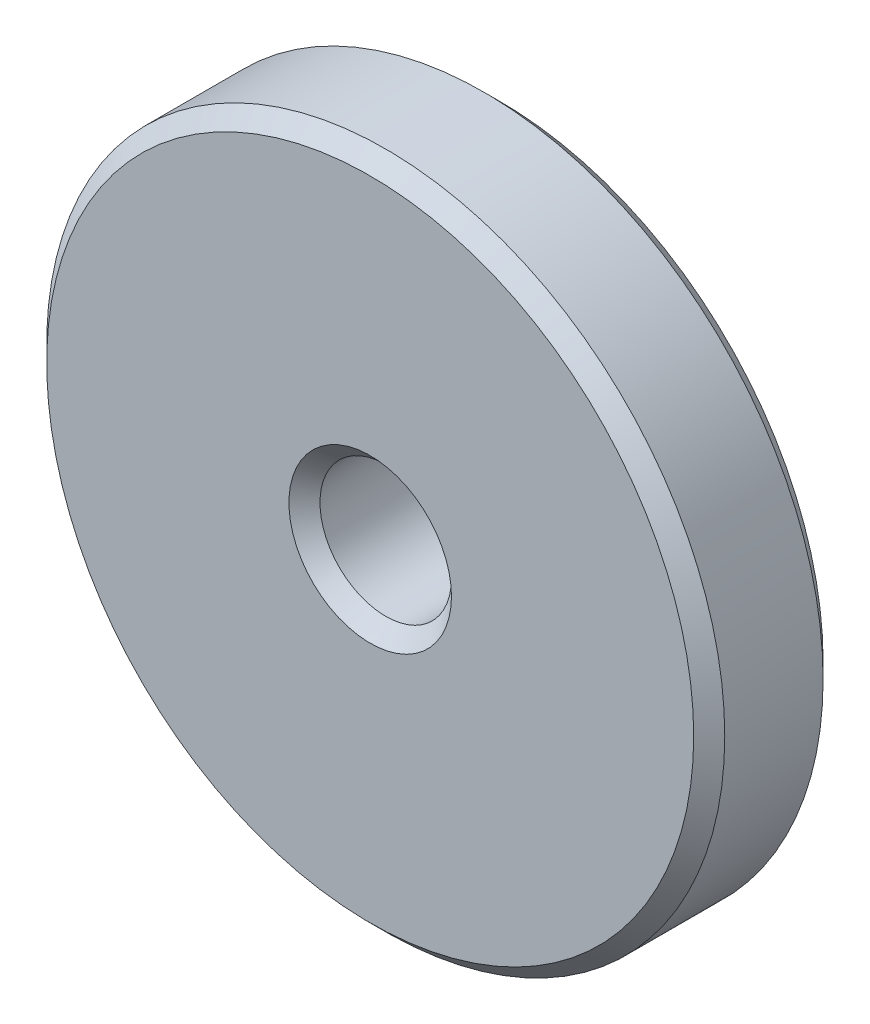
ISO-10303-21;
HEADER;
FILE_DESCRIPTION(('STEP AP214'),'2;1');
FILE_NAME('part.step','',(''),(''),'','','');
FILE_SCHEMA(('AUTOMOTIVE_DESIGN { 1 0 10303 214 1 1 1 1 }'));
ENDSEC;
DATA;
#1=APPLICATION_CONTEXT('core data for automotive mechanical design processes');
#2=APPLICATION_PROTOCOL_DEFINITION('international standard','automotive_design',2000,#1);
#3=PRODUCT_CONTEXT('',#1,'mechanical');
#4=PRODUCT('Part','Part','',(#3));
#5=PRODUCT_RELATED_PRODUCT_CATEGORY('part','',(#4));
#6=PRODUCT_DEFINITION_FORMATION('','',#4);
#7=PRODUCT_DEFINITION_CONTEXT('part definition',#1,'design');
#8=PRODUCT_DEFINITION('design','',#6,#7);
#9=PRODUCT_DEFINITION_SHAPE('','',#8);
#10=(LENGTH_UNIT() NAMED_UNIT(*) SI_UNIT(.MILLI.,.METRE.));
#11=(NAMED_UNIT(*) PLANE_ANGLE_UNIT() SI_UNIT($,.RADIAN.));
#12=(NAMED_UNIT(*) SI_UNIT($,.STERADIAN.) SOLID_ANGLE_UNIT());
#13=UNCERTAINTY_MEASURE_WITH_UNIT(LENGTH_MEASURE(1.E-05),#10,'distance_accuracy_value','');
#14=(GEOMETRIC_REPRESENTATION_CONTEXT(3) GLOBAL_UNCERTAINTY_ASSIGNED_CONTEXT((#13)) GLOBAL_UNIT_ASSIGNED_CONTEXT((#10,
#11,#12)) REPRESENTATION_CONTEXT('',''));
#15=CARTESIAN_POINT('',(0.,0.,0.));
#16=DIRECTION('',(0.,0.,1.));
#17=DIRECTION('',(1.,0.,0.));
#18=AXIS2_PLACEMENT_3D('',#15,#16,#17);
#19=CARTESIAN_POINT('',(0.,0.,12.5));
#20=DIRECTION('',(0.,0.,1.));
#21=DIRECTION('',(1.,0.,0.));
#22=AXIS2_PLACEMENT_3D('',#19,#20,#21);
#23=PLANE('',#22);
#24=CARTESIAN_POINT('',(0.,0.,12.5));
#25=DIRECTION('',(0.,0.,1.));
#26=DIRECTION('',(1.,0.,0.));
#27=AXIS2_PLACEMENT_3D('',#24,#25,#26);
#28=CIRCLE('',#27,15.7);
#29=CARTESIAN_POINT('',(15.7,0.,12.5));
#30=VERTEX_POINT('',#29);
#31=EDGE_CURVE('E10',#30,#30,#28,.F.);
#32=ORIENTED_EDGE('',*,*,#31,.T.);
#33=EDGE_LOOP('',(#32));
#34=FACE_BOUND('',#33,.T.);
#35=CARTESIAN_POINT('',(0.,0.,12.5));
#36=DIRECTION('',(0.,0.,1.));
#37=DIRECTION('',(1.,0.,0.));
#38=AXIS2_PLACEMENT_3D('',#35,#36,#37);
#39=CIRCLE('',#38,62.5);
#40=CARTESIAN_POINT('',(62.5,0.,12.5));
#41=VERTEX_POINT('',#40);
#42=EDGE_CURVE('E47',#41,#41,#39,.T.);
#43=ORIENTED_EDGE('',*,*,#42,.T.);
#44=EDGE_LOOP('',(#43));
#45=FACE_BOUND('',#44,.T.);
#46=ADVANCED_FACE('F39',(#34,#45),#23,.T.);
#47=CARTESIAN_POINT('',(0.,0.,-12.5));
#48=DIRECTION('',(0.,0.,1.));
#49=DIRECTION('',(1.,0.,0.));
#50=AXIS2_PLACEMENT_3D('',#47,#48,#49);
#51=PLANE('',#50);
#52=CARTESIAN_POINT('',(0.,0.,-12.5));
#53=DIRECTION('',(0.,0.,1.));
#54=DIRECTION('',(1.,0.,0.));
#55=AXIS2_PLACEMENT_3D('',#52,#53,#54);
#56=CIRCLE('',#55,15.7);
#57=CARTESIAN_POINT('',(15.7,0.,-12.5));
#58=VERTEX_POINT('',#57);
#59=EDGE_CURVE('E71',#58,#58,#56,.T.);
#60=ORIENTED_EDGE('',*,*,#59,.T.);
#61=EDGE_LOOP('',(#60));
#62=FACE_BOUND('',#61,.T.);
#63=CARTESIAN_POINT('',(0.,0.,-12.5));
#64=DIRECTION('',(0.,0.,1.));
#65=DIRECTION('',(1.,0.,0.));
#66=AXIS2_PLACEMENT_3D('',#63,#64,#65);
#67=CIRCLE('',#66,62.5);
#68=CARTESIAN_POINT('',(62.5,0.,-12.5));
#69=VERTEX_POINT('',#68);
#70=EDGE_CURVE('E75',#69,#69,#67,.F.);
#71=ORIENTED_EDGE('',*,*,#70,.T.);
#72=EDGE_LOOP('',(#71));
#73=FACE_BOUND('',#72,.T.);
#74=ADVANCED_FACE('F80',(#62,#73),#51,.F.);
#75=CARTESIAN_POINT('',(0.,0.,12.5));
#76=DIRECTION('',(0.,0.,-1.));
#77=DIRECTION('',(-1.,0.,0.));
#78=AXIS2_PLACEMENT_3D('',#75,#76,#77);
#79=CYLINDRICAL_SURFACE('',#78,65.5);
#80=CARTESIAN_POINT('',(0.,0.,-9.49999999999997));
#81=DIRECTION('',(0.,0.,1.));
#82=DIRECTION('',(1.,0.,0.));
#83=AXIS2_PLACEMENT_3D('',#80,#81,#82);
#84=CIRCLE('',#83,65.5);
#85=CARTESIAN_POINT('',(65.5,0.,-9.49999999999997));
#86=VERTEX_POINT('',#85);
#87=EDGE_CURVE('E52',#86,#86,#84,.T.);
#88=ORIENTED_EDGE('',*,*,#87,.T.);
#89=EDGE_LOOP('',(#88));
#90=FACE_BOUND('',#89,.T.);
#91=CARTESIAN_POINT('',(0.,0.,9.5));
#92=DIRECTION('',(0.,0.,1.));
#93=DIRECTION('',(1.,0.,0.));
#94=AXIS2_PLACEMENT_3D('',#91,#92,#93);
#95=CIRCLE('',#94,65.5);
#96=CARTESIAN_POINT('',(65.5,0.,9.5));
#97=VERTEX_POINT('',#96);
#98=EDGE_CURVE('E57',#97,#97,#95,.F.);
#99=ORIENTED_EDGE('',*,*,#98,.T.);
#100=EDGE_LOOP('',(#99));
#101=FACE_BOUND('',#100,.T.);
#102=ADVANCED_FACE('F90',(#90,#101),#79,.T.);
#103=CARTESIAN_POINT('',(0.,0.,12.5));
#104=DIRECTION('',(0.,0.,-1.));
#105=DIRECTION('',(-1.,0.,0.));
#106=AXIS2_PLACEMENT_3D('',#103,#104,#105);
#107=CYLINDRICAL_SURFACE('',#106,12.7);
#108=CARTESIAN_POINT('',(0.,0.,-9.49999999999998));
#109=DIRECTION('',(0.,0.,1.));
#110=DIRECTION('',(1.,0.,0.));
#111=AXIS2_PLACEMENT_3D('',#108,#109,#110);
#112=CIRCLE('',#111,12.7);
#113=CARTESIAN_POINT('',(12.7,0.,-9.49999999999998));
#114=VERTEX_POINT('',#113);
#115=EDGE_CURVE('E63',#114,#114,#112,.F.);
#116=ORIENTED_EDGE('',*,*,#115,.T.);
#117=EDGE_LOOP('',(#116));
#118=FACE_BOUND('',#117,.T.);
#119=CARTESIAN_POINT('',(0.,0.,9.49999999999999));
#120=DIRECTION('',(0.,0.,1.));
#121=DIRECTION('',(1.,0.,0.));
#122=AXIS2_PLACEMENT_3D('',#119,#120,#121);
#123=CIRCLE('',#122,12.7);
#124=CARTESIAN_POINT('',(12.7,0.,9.49999999999999));
#125=VERTEX_POINT('',#124);
#126=EDGE_CURVE('E67',#125,#125,#123,.T.);
#127=ORIENTED_EDGE('',*,*,#126,.T.);
#128=EDGE_LOOP('',(#127));
#129=FACE_BOUND('',#128,.T.);
#130=ADVANCED_FACE('F93',(#118,#129),#107,.F.);
#131=CARTESIAN_POINT('',(0.,0.,-12.5));
#132=DIRECTION('',(0.,0.,-1.));
#133=DIRECTION('',(-1.,0.,0.));
#134=AXIS2_PLACEMENT_3D('',#131,#132,#133);
#135=CONICAL_SURFACE('',#134,15.7,0.785398163397447);
#136=ORIENTED_EDGE('',*,*,#115,.F.);
#137=EDGE_LOOP('',(#136));
#138=FACE_BOUND('',#137,.T.);
#139=ORIENTED_EDGE('',*,*,#59,.F.);
#140=EDGE_LOOP('',(#139));
#141=FACE_BOUND('',#140,.T.);
#142=ADVANCED_FACE('F86',(#138,#141),#135,.F.);
#143=CARTESIAN_POINT('',(0.,0.,-9.49999999999997));
#144=DIRECTION('',(0.,0.,1.));
#145=DIRECTION('',(1.,0.,0.));
#146=AXIS2_PLACEMENT_3D('',#143,#144,#145);
#147=CONICAL_SURFACE('',#146,65.5,0.785398163397448);
#148=ORIENTED_EDGE('',*,*,#70,.F.);
#149=EDGE_LOOP('',(#148));
#150=FACE_BOUND('',#149,.T.);
#151=ORIENTED_EDGE('',*,*,#87,.F.);
#152=EDGE_LOOP('',(#151));
#153=FACE_BOUND('',#152,.T.);
#154=ADVANCED_FACE('F82',(#150,#153),#147,.T.);
#155=CARTESIAN_POINT('',(0.,0.,9.49999999999999));
#156=DIRECTION('',(0.,0.,1.));
#157=DIRECTION('',(1.,0.,0.));
#158=AXIS2_PLACEMENT_3D('',#155,#156,#157);
#159=CONICAL_SURFACE('',#158,12.7,0.785398163397445);
#160=ORIENTED_EDGE('',*,*,#31,.F.);
#161=EDGE_LOOP('',(#160));
#162=FACE_BOUND('',#161,.T.);
#163=ORIENTED_EDGE('',*,*,#126,.F.);
#164=EDGE_LOOP('',(#163));
#165=FACE_BOUND('',#164,.T.);
#166=ADVANCED_FACE('F85',(#162,#165),#159,.F.);
#167=CARTESIAN_POINT('',(0.,0.,12.5));
#168=DIRECTION('',(0.,0.,-1.));
#169=DIRECTION('',(-1.,0.,0.));
#170=AXIS2_PLACEMENT_3D('',#167,#168,#169);
#171=CONICAL_SURFACE('',#170,62.5,0.785398163397451);
#172=ORIENTED_EDGE('',*,*,#98,.F.);
#173=EDGE_LOOP('',(#172));
#174=FACE_BOUND('',#173,.T.);
#175=ORIENTED_EDGE('',*,*,#42,.F.);
#176=EDGE_LOOP('',(#175));
#177=FACE_BOUND('',#176,.T.);
#178=ADVANCED_FACE('F41',(#174,#177),#171,.T.);
#179=CLOSED_SHELL('',(#46,#74,#102,#130,#142,#154,#166,#178));
#180=MANIFOLD_SOLID_BREP('B2',#179);
#181=ADVANCED_BREP_SHAPE_REPRESENTATION('',(#18,#180),#14);
#182=SHAPE_DEFINITION_REPRESENTATION(#9,#181);
ENDSEC;
END-ISO-10303-21;
